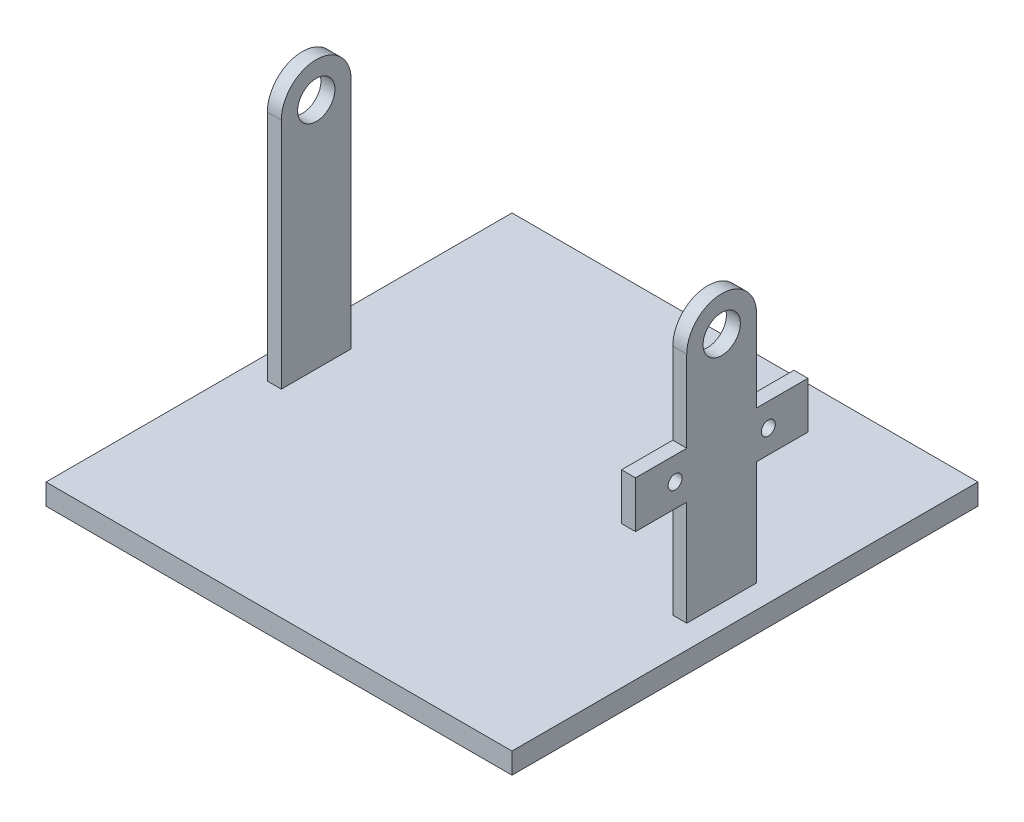
ISO-10303-21;
HEADER;
FILE_DESCRIPTION(('STEP AP214'),'2;1');
FILE_NAME('part.step','',(''),(''),'','','');
FILE_SCHEMA(('AUTOMOTIVE_DESIGN { 1 0 10303 214 1 1 1 1 }'));
ENDSEC;
DATA;
#1=APPLICATION_CONTEXT('core data for automotive mechanical design processes');
#2=APPLICATION_PROTOCOL_DEFINITION('international standard','automotive_design',2000,#1);
#3=PRODUCT_CONTEXT('',#1,'mechanical');
#4=PRODUCT('Part','Part','',(#3));
#5=PRODUCT_RELATED_PRODUCT_CATEGORY('part','',(#4));
#6=PRODUCT_DEFINITION_FORMATION('','',#4);
#7=PRODUCT_DEFINITION_CONTEXT('part definition',#1,'design');
#8=PRODUCT_DEFINITION('design','',#6,#7);
#9=PRODUCT_DEFINITION_SHAPE('','',#8);
#10=(LENGTH_UNIT() NAMED_UNIT(*) SI_UNIT(.MILLI.,.METRE.));
#11=(NAMED_UNIT(*) PLANE_ANGLE_UNIT() SI_UNIT($,.RADIAN.));
#12=(NAMED_UNIT(*) SI_UNIT($,.STERADIAN.) SOLID_ANGLE_UNIT());
#13=UNCERTAINTY_MEASURE_WITH_UNIT(LENGTH_MEASURE(1.E-05),#10,'distance_accuracy_value','');
#14=(GEOMETRIC_REPRESENTATION_CONTEXT(3) GLOBAL_UNCERTAINTY_ASSIGNED_CONTEXT((#13)) GLOBAL_UNIT_ASSIGNED_CONTEXT((#10,
#11,#12)) REPRESENTATION_CONTEXT('',''));
#15=CARTESIAN_POINT('',(0.,0.,0.));
#16=DIRECTION('',(0.,0.,1.));
#17=DIRECTION('',(1.,0.,0.));
#18=AXIS2_PLACEMENT_3D('',#15,#16,#17);
#19=CARTESIAN_POINT('',(45.,64.5,-7.50000000000004));
#20=DIRECTION('',(0.,0.,1.));
#21=DIRECTION('',(1.,0.,0.));
#22=AXIS2_PLACEMENT_3D('',#19,#20,#21);
#23=PLANE('',#22);
#24=DIRECTION('',(0.,-1.,0.));
#25=VECTOR('',#24,1.);
#26=CARTESIAN_POINT('',(45.,64.5,-7.50000000000004));
#27=LINE('',#26,#25);
#28=CARTESIAN_POINT('',(45.,54.5,-7.49999999999998));
#29=VERTEX_POINT('',#28);
#30=CARTESIAN_POINT('',(45.,37.02,-7.50000000000004));
#31=VERTEX_POINT('',#30);
#32=EDGE_CURVE('E62',#29,#31,#27,.T.);
#33=ORIENTED_EDGE('',*,*,#32,.T.);
#34=DIRECTION('',(-1.,0.,0.));
#35=VECTOR('',#34,1.);
#36=CARTESIAN_POINT('',(45.,37.02,-7.50000000000004));
#37=LINE('',#36,#35);
#38=CARTESIAN_POINT('',(42.,37.02,-7.50000000000004));
#39=VERTEX_POINT('',#38);
#40=EDGE_CURVE('E409',#31,#39,#37,.T.);
#41=ORIENTED_EDGE('',*,*,#40,.T.);
#42=DIRECTION('',(0.,-1.,0.));
#43=VECTOR('',#42,1.);
#44=CARTESIAN_POINT('',(42.,64.5,-7.50000000000004));
#45=LINE('',#44,#43);
#46=CARTESIAN_POINT('',(42.,54.5,-7.49999999999998));
#47=VERTEX_POINT('',#46);
#48=EDGE_CURVE('E279',#47,#39,#45,.T.);
#49=ORIENTED_EDGE('',*,*,#48,.F.);
#50=DIRECTION('',(1.,0.,0.));
#51=VECTOR('',#50,1.);
#52=CARTESIAN_POINT('',(-50.,54.5,-7.49999999999998));
#53=LINE('',#52,#51);
#54=EDGE_CURVE('E410',#47,#29,#53,.T.);
#55=ORIENTED_EDGE('',*,*,#54,.T.);
#56=EDGE_LOOP('',(#33,#41,#49,#55));
#57=FACE_BOUND('',#56,.T.);
#58=ADVANCED_FACE('F46',(#57),#23,.F.);
#59=CARTESIAN_POINT('',(45.,64.5,7.49999999999996));
#60=DIRECTION('',(0.,0.,-1.));
#61=DIRECTION('',(-1.,0.,0.));
#62=AXIS2_PLACEMENT_3D('',#59,#60,#61);
#63=PLANE('',#62);
#64=DIRECTION('',(0.,-1.,0.));
#65=VECTOR('',#64,1.);
#66=CARTESIAN_POINT('',(42.,64.5,7.49999999999996));
#67=LINE('',#66,#65);
#68=CARTESIAN_POINT('',(42.,54.5,7.49999999999996));
#69=VERTEX_POINT('',#68);
#70=CARTESIAN_POINT('',(42.,37.02,7.49999999999997));
#71=VERTEX_POINT('',#70);
#72=EDGE_CURVE('E254',#69,#71,#67,.T.);
#73=ORIENTED_EDGE('',*,*,#72,.T.);
#74=DIRECTION('',(1.,0.,0.));
#75=VECTOR('',#74,1.);
#76=CARTESIAN_POINT('',(45.,37.02,7.49999999999996));
#77=LINE('',#76,#75);
#78=CARTESIAN_POINT('',(45.,37.02,7.49999999999996));
#79=VERTEX_POINT('',#78);
#80=EDGE_CURVE('E12',#71,#79,#77,.T.);
#81=ORIENTED_EDGE('',*,*,#80,.T.);
#82=DIRECTION('',(0.,-1.,0.));
#83=VECTOR('',#82,1.);
#84=CARTESIAN_POINT('',(45.,64.5,7.49999999999996));
#85=LINE('',#84,#83);
#86=CARTESIAN_POINT('',(45.,54.5,7.49999999999997));
#87=VERTEX_POINT('',#86);
#88=EDGE_CURVE('E246',#87,#79,#85,.T.);
#89=ORIENTED_EDGE('',*,*,#88,.F.);
#90=DIRECTION('',(1.,0.,0.));
#91=VECTOR('',#90,1.);
#92=CARTESIAN_POINT('',(-50.,54.5,7.49999999999997));
#93=LINE('',#92,#91);
#94=EDGE_CURVE('E405',#69,#87,#93,.T.);
#95=ORIENTED_EDGE('',*,*,#94,.F.);
#96=EDGE_LOOP('',(#73,#81,#89,#95));
#97=FACE_BOUND('',#96,.T.);
#98=ADVANCED_FACE('F475',(#97),#63,.F.);
#99=CARTESIAN_POINT('',(-45.,64.5,-7.50000000000003));
#100=DIRECTION('',(0.,0.,1.));
#101=DIRECTION('',(1.,0.,0.));
#102=AXIS2_PLACEMENT_3D('',#99,#100,#101);
#103=PLANE('',#102);
#104=CARTESIAN_POINT('',(-45.,54.5,-7.49999999999998));
#105=VERTEX_POINT('',#104);
#106=CARTESIAN_POINT('',(-42.,54.5,-7.49999999999998));
#107=VERTEX_POINT('',#106);
#108=EDGE_CURVE('E404',#105,#107,#53,.T.);
#109=ORIENTED_EDGE('',*,*,#108,.T.);
#110=DIRECTION('',(0.,-1.,0.));
#111=VECTOR('',#110,1.);
#112=CARTESIAN_POINT('',(-42.,64.5,-7.50000000000003));
#113=LINE('',#112,#111);
#114=CARTESIAN_POINT('',(-42.,4.5,-7.50000000000003));
#115=VERTEX_POINT('',#114);
#116=EDGE_CURVE('E318',#107,#115,#113,.T.);
#117=ORIENTED_EDGE('',*,*,#116,.T.);
#118=DIRECTION('',(-1.,0.,0.));
#119=VECTOR('',#118,1.);
#120=CARTESIAN_POINT('',(-45.,4.5,-7.50000000000003));
#121=LINE('',#120,#119);
#122=CARTESIAN_POINT('',(-45.,4.5,-7.50000000000003));
#123=VERTEX_POINT('',#122);
#124=EDGE_CURVE('E546',#115,#123,#121,.T.);
#125=ORIENTED_EDGE('',*,*,#124,.T.);
#126=DIRECTION('',(0.,-1.,0.));
#127=VECTOR('',#126,1.);
#128=CARTESIAN_POINT('',(-45.,64.5,-7.50000000000003));
#129=LINE('',#128,#127);
#130=EDGE_CURVE('E566',#105,#123,#129,.T.);
#131=ORIENTED_EDGE('',*,*,#130,.F.);
#132=EDGE_LOOP('',(#109,#117,#125,#131));
#133=FACE_BOUND('',#132,.T.);
#134=ADVANCED_FACE('F480',(#133),#103,.F.);
#135=CARTESIAN_POINT('',(42.,27.02,-7.50000000000004));
#136=VERTEX_POINT('',#135);
#137=CARTESIAN_POINT('',(42.,4.5,-7.50000000000004));
#138=VERTEX_POINT('',#137);
#139=EDGE_CURVE('E70',#136,#138,#45,.T.);
#140=ORIENTED_EDGE('',*,*,#139,.F.);
#141=DIRECTION('',(1.,0.,0.));
#142=VECTOR('',#141,1.);
#143=CARTESIAN_POINT('',(45.,27.02,-7.50000000000004));
#144=LINE('',#143,#142);
#145=CARTESIAN_POINT('',(45.,27.02,-7.50000000000004));
#146=VERTEX_POINT('',#145);
#147=EDGE_CURVE('E192',#136,#146,#144,.T.);
#148=ORIENTED_EDGE('',*,*,#147,.T.);
#149=CARTESIAN_POINT('',(45.,4.5,-7.50000000000004));
#150=VERTEX_POINT('',#149);
#151=EDGE_CURVE('E276',#146,#150,#27,.T.);
#152=ORIENTED_EDGE('',*,*,#151,.T.);
#153=DIRECTION('',(-1.,0.,0.));
#154=VECTOR('',#153,1.);
#155=CARTESIAN_POINT('',(45.,4.5,-7.50000000000004));
#156=LINE('',#155,#154);
#157=EDGE_CURVE('E285',#150,#138,#156,.T.);
#158=ORIENTED_EDGE('',*,*,#157,.T.);
#159=EDGE_LOOP('',(#140,#148,#152,#158));
#160=FACE_BOUND('',#159,.T.);
#161=ADVANCED_FACE('F374',(#160),#23,.F.);
#162=CARTESIAN_POINT('',(0.,4.5,0.));
#163=DIRECTION('',(0.,-1.,0.));
#164=DIRECTION('',(0.,0.,-1.));
#165=AXIS2_PLACEMENT_3D('',#162,#163,#164);
#166=PLANE('',#165);
#167=DIRECTION('',(0.,0.,-1.));
#168=VECTOR('',#167,1.);
#169=CARTESIAN_POINT('',(-42.,4.5,7.49999999999997));
#170=LINE('',#169,#168);
#171=CARTESIAN_POINT('',(-42.,4.5,7.49999999999997));
#172=VERTEX_POINT('',#171);
#173=EDGE_CURVE('E296',#172,#115,#170,.T.);
#174=ORIENTED_EDGE('',*,*,#173,.F.);
#175=DIRECTION('',(1.,0.,0.));
#176=VECTOR('',#175,1.);
#177=CARTESIAN_POINT('',(-45.,4.5,7.49999999999997));
#178=LINE('',#177,#176);
#179=CARTESIAN_POINT('',(-45.,4.5,7.49999999999997));
#180=VERTEX_POINT('',#179);
#181=EDGE_CURVE('E555',#180,#172,#178,.T.);
#182=ORIENTED_EDGE('',*,*,#181,.F.);
#183=DIRECTION('',(0.,0.,1.));
#184=VECTOR('',#183,1.);
#185=CARTESIAN_POINT('',(-45.,4.5,7.49999999999997));
#186=LINE('',#185,#184);
#187=EDGE_CURVE('E550',#123,#180,#186,.T.);
#188=ORIENTED_EDGE('',*,*,#187,.F.);
#189=ORIENTED_EDGE('',*,*,#124,.F.);
#190=EDGE_LOOP('',(#174,#182,#188,#189));
#191=FACE_BOUND('',#190,.T.);
#192=DIRECTION('',(0.,0.,-1.));
#193=VECTOR('',#192,1.);
#194=CARTESIAN_POINT('',(50.,4.5,50.));
#195=LINE('',#194,#193);
#196=CARTESIAN_POINT('',(50.,4.5,50.));
#197=VERTEX_POINT('',#196);
#198=CARTESIAN_POINT('',(50.,4.5,-50.));
#199=VERTEX_POINT('',#198);
#200=EDGE_CURVE('E327',#197,#199,#195,.T.);
#201=ORIENTED_EDGE('',*,*,#200,.T.);
#202=DIRECTION('',(-1.,0.,0.));
#203=VECTOR('',#202,1.);
#204=CARTESIAN_POINT('',(-50.,4.5,-50.));
#205=LINE('',#204,#203);
#206=CARTESIAN_POINT('',(-50.,4.5,-50.));
#207=VERTEX_POINT('',#206);
#208=EDGE_CURVE('E534',#199,#207,#205,.T.);
#209=ORIENTED_EDGE('',*,*,#208,.T.);
#210=DIRECTION('',(0.,0.,1.));
#211=VECTOR('',#210,1.);
#212=CARTESIAN_POINT('',(-50.,4.5,50.));
#213=LINE('',#212,#211);
#214=CARTESIAN_POINT('',(-50.,4.5,50.));
#215=VERTEX_POINT('',#214);
#216=EDGE_CURVE('E310',#207,#215,#213,.T.);
#217=ORIENTED_EDGE('',*,*,#216,.T.);
#218=DIRECTION('',(1.,0.,0.));
#219=VECTOR('',#218,1.);
#220=CARTESIAN_POINT('',(-50.,4.5,50.));
#221=LINE('',#220,#219);
#222=EDGE_CURVE('E305',#215,#197,#221,.T.);
#223=ORIENTED_EDGE('',*,*,#222,.T.);
#224=EDGE_LOOP('',(#201,#209,#217,#223));
#225=FACE_BOUND('',#224,.T.);
#226=DIRECTION('',(0.,0.,-1.));
#227=VECTOR('',#226,1.);
#228=CARTESIAN_POINT('',(45.,4.5,7.49999999999996));
#229=LINE('',#228,#227);
#230=CARTESIAN_POINT('',(45.,4.5,7.49999999999996));
#231=VERTEX_POINT('',#230);
#232=EDGE_CURVE('E289',#231,#150,#229,.T.);
#233=ORIENTED_EDGE('',*,*,#232,.F.);
#234=DIRECTION('',(1.,0.,0.));
#235=VECTOR('',#234,1.);
#236=CARTESIAN_POINT('',(45.,4.5,7.49999999999996));
#237=LINE('',#236,#235);
#238=CARTESIAN_POINT('',(42.,4.5,7.49999999999996));
#239=VERTEX_POINT('',#238);
#240=EDGE_CURVE('E252',#239,#231,#237,.T.);
#241=ORIENTED_EDGE('',*,*,#240,.F.);
#242=DIRECTION('',(0.,0.,1.));
#243=VECTOR('',#242,1.);
#244=CARTESIAN_POINT('',(42.,4.5,7.49999999999996));
#245=LINE('',#244,#243);
#246=EDGE_CURVE('E290',#138,#239,#245,.T.);
#247=ORIENTED_EDGE('',*,*,#246,.F.);
#248=ORIENTED_EDGE('',*,*,#157,.F.);
#249=EDGE_LOOP('',(#233,#241,#247,#248));
#250=FACE_BOUND('',#249,.T.);
#251=ADVANCED_FACE('F372',(#191,#225,#250),#166,.F.);
#252=CARTESIAN_POINT('',(50.,4.5,50.));
#253=DIRECTION('',(-1.,0.,0.));
#254=DIRECTION('',(0.,0.,1.));
#255=AXIS2_PLACEMENT_3D('',#252,#253,#254);
#256=PLANE('',#255);
#257=DIRECTION('',(0.,0.,-1.));
#258=VECTOR('',#257,1.);
#259=CARTESIAN_POINT('',(50.,0.,50.));
#260=LINE('',#259,#258);
#261=CARTESIAN_POINT('',(50.,0.,50.));
#262=VERTEX_POINT('',#261);
#263=CARTESIAN_POINT('',(50.,0.,-50.));
#264=VERTEX_POINT('',#263);
#265=EDGE_CURVE('E313',#262,#264,#260,.T.);
#266=ORIENTED_EDGE('',*,*,#265,.T.);
#267=DIRECTION('',(0.,-1.,0.));
#268=VECTOR('',#267,1.);
#269=CARTESIAN_POINT('',(50.,4.5,-50.));
#270=LINE('',#269,#268);
#271=EDGE_CURVE('E339',#199,#264,#270,.T.);
#272=ORIENTED_EDGE('',*,*,#271,.F.);
#273=ORIENTED_EDGE('',*,*,#200,.F.);
#274=DIRECTION('',(0.,-1.,0.));
#275=VECTOR('',#274,1.);
#276=CARTESIAN_POINT('',(50.,4.5,50.));
#277=LINE('',#276,#275);
#278=EDGE_CURVE('E309',#197,#262,#277,.T.);
#279=ORIENTED_EDGE('',*,*,#278,.T.);
#280=EDGE_LOOP('',(#266,#272,#273,#279));
#281=FACE_BOUND('',#280,.T.);
#282=ADVANCED_FACE('F48',(#281),#256,.F.);
#283=CARTESIAN_POINT('',(-50.,4.5,-50.));
#284=DIRECTION('',(0.,0.,1.));
#285=DIRECTION('',(1.,0.,0.));
#286=AXIS2_PLACEMENT_3D('',#283,#284,#285);
#287=PLANE('',#286);
#288=DIRECTION('',(-1.,0.,0.));
#289=VECTOR('',#288,1.);
#290=CARTESIAN_POINT('',(-50.,0.,-50.));
#291=LINE('',#290,#289);
#292=CARTESIAN_POINT('',(-50.,0.,-50.));
#293=VERTEX_POINT('',#292);
#294=EDGE_CURVE('E317',#264,#293,#291,.T.);
#295=ORIENTED_EDGE('',*,*,#294,.T.);
#296=DIRECTION('',(0.,-1.,0.));
#297=VECTOR('',#296,1.);
#298=CARTESIAN_POINT('',(-50.,4.5,-50.));
#299=LINE('',#298,#297);
#300=EDGE_CURVE('E335',#207,#293,#299,.T.);
#301=ORIENTED_EDGE('',*,*,#300,.F.);
#302=ORIENTED_EDGE('',*,*,#208,.F.);
#303=ORIENTED_EDGE('',*,*,#271,.T.);
#304=EDGE_LOOP('',(#295,#301,#302,#303));
#305=FACE_BOUND('',#304,.T.);
#306=ADVANCED_FACE('F513',(#305),#287,.F.);
#307=CARTESIAN_POINT('',(-50.,4.5,50.));
#308=DIRECTION('',(1.,0.,0.));
#309=DIRECTION('',(0.,0.,-1.));
#310=AXIS2_PLACEMENT_3D('',#307,#308,#309);
#311=PLANE('',#310);
#312=DIRECTION('',(0.,0.,1.));
#313=VECTOR('',#312,1.);
#314=CARTESIAN_POINT('',(-50.,0.,50.));
#315=LINE('',#314,#313);
#316=CARTESIAN_POINT('',(-50.,0.,50.));
#317=VERTEX_POINT('',#316);
#318=EDGE_CURVE('E321',#293,#317,#315,.T.);
#319=ORIENTED_EDGE('',*,*,#318,.T.);
#320=DIRECTION('',(0.,-1.,0.));
#321=VECTOR('',#320,1.);
#322=CARTESIAN_POINT('',(-50.,4.5,50.));
#323=LINE('',#322,#321);
#324=EDGE_CURVE('E331',#215,#317,#323,.T.);
#325=ORIENTED_EDGE('',*,*,#324,.F.);
#326=ORIENTED_EDGE('',*,*,#216,.F.);
#327=ORIENTED_EDGE('',*,*,#300,.T.);
#328=EDGE_LOOP('',(#319,#325,#326,#327));
#329=FACE_BOUND('',#328,.T.);
#330=ADVANCED_FACE('F510',(#329),#311,.F.);
#331=CARTESIAN_POINT('',(-50.,4.5,50.));
#332=DIRECTION('',(0.,0.,-1.));
#333=DIRECTION('',(-1.,0.,0.));
#334=AXIS2_PLACEMENT_3D('',#331,#332,#333);
#335=PLANE('',#334);
#336=DIRECTION('',(1.,0.,0.));
#337=VECTOR('',#336,1.);
#338=CARTESIAN_POINT('',(-50.,0.,50.));
#339=LINE('',#338,#337);
#340=EDGE_CURVE('E324',#317,#262,#339,.T.);
#341=ORIENTED_EDGE('',*,*,#340,.T.);
#342=ORIENTED_EDGE('',*,*,#278,.F.);
#343=ORIENTED_EDGE('',*,*,#222,.F.);
#344=ORIENTED_EDGE('',*,*,#324,.T.);
#345=EDGE_LOOP('',(#341,#342,#343,#344));
#346=FACE_BOUND('',#345,.T.);
#347=ADVANCED_FACE('F506',(#346),#335,.F.);
#348=CARTESIAN_POINT('',(0.,0.,0.));
#349=DIRECTION('',(0.,-1.,0.));
#350=DIRECTION('',(0.,0.,-1.));
#351=AXIS2_PLACEMENT_3D('',#348,#349,#350);
#352=PLANE('',#351);
#353=ORIENTED_EDGE('',*,*,#265,.F.);
#354=ORIENTED_EDGE('',*,*,#340,.F.);
#355=ORIENTED_EDGE('',*,*,#318,.F.);
#356=ORIENTED_EDGE('',*,*,#294,.F.);
#357=EDGE_LOOP('',(#353,#354,#355,#356));
#358=FACE_BOUND('',#357,.T.);
#359=ADVANCED_FACE('F502',(#358),#352,.T.);
#360=CARTESIAN_POINT('',(-42.,64.5,7.49999999999997));
#361=DIRECTION('',(-1.,0.,0.));
#362=DIRECTION('',(0.,0.,1.));
#363=AXIS2_PLACEMENT_3D('',#360,#361,#362);
#364=PLANE('',#363);
#365=CARTESIAN_POINT('',(-42.,54.5,0.));
#366=DIRECTION('',(-1.,0.,0.));
#367=DIRECTION('',(0.,0.,1.));
#368=AXIS2_PLACEMENT_3D('',#365,#366,#367);
#369=CIRCLE('',#368,4.);
#370=CARTESIAN_POINT('',(-42.,54.5,4.));
#371=VERTEX_POINT('',#370);
#372=EDGE_CURVE('E277',#371,#371,#369,.T.);
#373=ORIENTED_EDGE('',*,*,#372,.T.);
#374=EDGE_LOOP('',(#373));
#375=FACE_BOUND('',#374,.T.);
#376=ORIENTED_EDGE('',*,*,#116,.F.);
#377=CARTESIAN_POINT('',(-42.,54.5,0.));
#378=DIRECTION('',(-1.,0.,0.));
#379=DIRECTION('',(0.,0.,1.));
#380=AXIS2_PLACEMENT_3D('',#377,#378,#379);
#381=CIRCLE('',#380,7.49999999999997);
#382=CARTESIAN_POINT('',(-42.,54.5,7.49999999999997));
#383=VERTEX_POINT('',#382);
#384=EDGE_CURVE('E347',#107,#383,#381,.F.);
#385=ORIENTED_EDGE('',*,*,#384,.T.);
#386=DIRECTION('',(0.,-1.,0.));
#387=VECTOR('',#386,1.);
#388=CARTESIAN_POINT('',(-42.,64.5,7.49999999999997));
#389=LINE('',#388,#387);
#390=EDGE_CURVE('E560',#383,#172,#389,.T.);
#391=ORIENTED_EDGE('',*,*,#390,.T.);
#392=ORIENTED_EDGE('',*,*,#173,.T.);
#393=EDGE_LOOP('',(#376,#385,#391,#392));
#394=FACE_BOUND('',#393,.T.);
#395=ADVANCED_FACE('F500',(#375,#394),#364,.F.);
#396=CARTESIAN_POINT('',(-45.,64.5,7.49999999999997));
#397=DIRECTION('',(1.,0.,0.));
#398=DIRECTION('',(0.,0.,-1.));
#399=AXIS2_PLACEMENT_3D('',#396,#397,#398);
#400=PLANE('',#399);
#401=CARTESIAN_POINT('',(-45.,54.5,0.));
#402=DIRECTION('',(1.,0.,0.));
#403=DIRECTION('',(0.,0.,-1.));
#404=AXIS2_PLACEMENT_3D('',#401,#402,#403);
#405=CIRCLE('',#404,4.);
#406=CARTESIAN_POINT('',(-45.,54.5,-4.));
#407=VERTEX_POINT('',#406);
#408=EDGE_CURVE('E346',#407,#407,#405,.T.);
#409=ORIENTED_EDGE('',*,*,#408,.T.);
#410=EDGE_LOOP('',(#409));
#411=FACE_BOUND('',#410,.T.);
#412=DIRECTION('',(0.,-1.,0.));
#413=VECTOR('',#412,1.);
#414=CARTESIAN_POINT('',(-45.,64.5,7.49999999999997));
#415=LINE('',#414,#413);
#416=CARTESIAN_POINT('',(-45.,54.5,7.49999999999997));
#417=VERTEX_POINT('',#416);
#418=EDGE_CURVE('E564',#417,#180,#415,.T.);
#419=ORIENTED_EDGE('',*,*,#418,.F.);
#420=CARTESIAN_POINT('',(-45.,54.5,0.));
#421=DIRECTION('',(1.,0.,0.));
#422=DIRECTION('',(0.,0.,-1.));
#423=AXIS2_PLACEMENT_3D('',#420,#421,#422);
#424=CIRCLE('',#423,7.49999999999997);
#425=EDGE_CURVE('E389',#417,#105,#424,.F.);
#426=ORIENTED_EDGE('',*,*,#425,.T.);
#427=ORIENTED_EDGE('',*,*,#130,.T.);
#428=ORIENTED_EDGE('',*,*,#187,.T.);
#429=EDGE_LOOP('',(#419,#426,#427,#428));
#430=FACE_BOUND('',#429,.T.);
#431=ADVANCED_FACE('F498',(#411,#430),#400,.F.);
#432=CARTESIAN_POINT('',(-45.,64.5,7.49999999999997));
#433=DIRECTION('',(0.,0.,-1.));
#434=DIRECTION('',(-1.,0.,0.));
#435=AXIS2_PLACEMENT_3D('',#432,#433,#434);
#436=PLANE('',#435);
#437=ORIENTED_EDGE('',*,*,#390,.F.);
#438=EDGE_CURVE('E408',#417,#383,#93,.T.);
#439=ORIENTED_EDGE('',*,*,#438,.F.);
#440=ORIENTED_EDGE('',*,*,#418,.T.);
#441=ORIENTED_EDGE('',*,*,#181,.T.);
#442=EDGE_LOOP('',(#437,#439,#440,#441));
#443=FACE_BOUND('',#442,.T.);
#444=ADVANCED_FACE('F457',(#443),#436,.F.);
#445=CARTESIAN_POINT('',(45.,64.5,7.49999999999996));
#446=DIRECTION('',(-1.,0.,0.));
#447=DIRECTION('',(0.,0.,1.));
#448=AXIS2_PLACEMENT_3D('',#445,#446,#447);
#449=PLANE('',#448);
#450=ORIENTED_EDGE('',*,*,#151,.F.);
#451=DIRECTION('',(0.,0.,-1.));
#452=VECTOR('',#451,1.);
#453=CARTESIAN_POINT('',(45.,27.02,0.));
#454=LINE('',#453,#452);
#455=CARTESIAN_POINT('',(45.,27.02,-18.5));
#456=VERTEX_POINT('',#455);
#457=EDGE_CURVE('E231',#146,#456,#454,.T.);
#458=ORIENTED_EDGE('',*,*,#457,.T.);
#459=DIRECTION('',(0.,1.,0.));
#460=VECTOR('',#459,1.);
#461=CARTESIAN_POINT('',(45.,27.02,-18.5));
#462=LINE('',#461,#460);
#463=CARTESIAN_POINT('',(45.,37.02,-18.5));
#464=VERTEX_POINT('',#463);
#465=EDGE_CURVE('E204',#456,#464,#462,.T.);
#466=ORIENTED_EDGE('',*,*,#465,.T.);
#467=DIRECTION('',(0.,0.,1.));
#468=VECTOR('',#467,1.);
#469=CARTESIAN_POINT('',(45.,37.02,-18.5));
#470=LINE('',#469,#468);
#471=EDGE_CURVE('E263',#464,#31,#470,.T.);
#472=ORIENTED_EDGE('',*,*,#471,.T.);
#473=ORIENTED_EDGE('',*,*,#32,.F.);
#474=CARTESIAN_POINT('',(45.,54.5,0.));
#475=DIRECTION('',(-1.,0.,0.));
#476=DIRECTION('',(0.,0.,-1.));
#477=AXIS2_PLACEMENT_3D('',#474,#475,#476);
#478=CIRCLE('',#477,7.49999999999997);
#479=EDGE_CURVE('E400',#87,#29,#478,.T.);
#480=ORIENTED_EDGE('',*,*,#479,.F.);
#481=ORIENTED_EDGE('',*,*,#88,.T.);
#482=CARTESIAN_POINT('',(45.,37.02,18.5));
#483=VERTEX_POINT('',#482);
#484=EDGE_CURVE('E267',#79,#483,#470,.T.);
#485=ORIENTED_EDGE('',*,*,#484,.T.);
#486=DIRECTION('',(0.,-1.,0.));
#487=VECTOR('',#486,1.);
#488=CARTESIAN_POINT('',(45.,37.02,18.5));
#489=LINE('',#488,#487);
#490=CARTESIAN_POINT('',(45.,27.02,18.5));
#491=VERTEX_POINT('',#490);
#492=EDGE_CURVE('E197',#483,#491,#489,.T.);
#493=ORIENTED_EDGE('',*,*,#492,.T.);
#494=CARTESIAN_POINT('',(45.,27.02,7.49999999999996));
#495=VERTEX_POINT('',#494);
#496=EDGE_CURVE('E227',#491,#495,#454,.T.);
#497=ORIENTED_EDGE('',*,*,#496,.T.);
#498=EDGE_CURVE('E253',#495,#231,#85,.T.);
#499=ORIENTED_EDGE('',*,*,#498,.T.);
#500=ORIENTED_EDGE('',*,*,#232,.T.);
#501=EDGE_LOOP('',(#450,#458,#466,#472,#473,#480,#481,#485,#493,#497,#499,#500));
#502=FACE_BOUND('',#501,.T.);
#503=CARTESIAN_POINT('',(45.,32.02,10.));
#504=DIRECTION('',(1.,0.,0.));
#505=DIRECTION('',(0.,0.,-1.));
#506=AXIS2_PLACEMENT_3D('',#503,#504,#505);
#507=CIRCLE('',#506,1.5);
#508=CARTESIAN_POINT('',(45.,32.02,8.5));
#509=VERTEX_POINT('',#508);
#510=EDGE_CURVE('E447',#509,#509,#507,.T.);
#511=ORIENTED_EDGE('',*,*,#510,.F.);
#512=EDGE_LOOP('',(#511));
#513=FACE_BOUND('',#512,.T.);
#514=CARTESIAN_POINT('',(45.,54.5,0.));
#515=DIRECTION('',(1.,0.,0.));
#516=DIRECTION('',(0.,0.,-1.));
#517=AXIS2_PLACEMENT_3D('',#514,#515,#516);
#518=CIRCLE('',#517,4.);
#519=CARTESIAN_POINT('',(45.,54.5,-4.));
#520=VERTEX_POINT('',#519);
#521=EDGE_CURVE('E396',#520,#520,#518,.T.);
#522=ORIENTED_EDGE('',*,*,#521,.F.);
#523=EDGE_LOOP('',(#522));
#524=FACE_BOUND('',#523,.T.);
#525=CARTESIAN_POINT('',(45.,32.02,-10.));
#526=DIRECTION('',(1.,0.,0.));
#527=DIRECTION('',(0.,0.,-1.));
#528=AXIS2_PLACEMENT_3D('',#525,#526,#527);
#529=CIRCLE('',#528,1.5);
#530=CARTESIAN_POINT('',(45.,32.02,-11.5));
#531=VERTEX_POINT('',#530);
#532=EDGE_CURVE('E440',#531,#531,#529,.T.);
#533=ORIENTED_EDGE('',*,*,#532,.F.);
#534=EDGE_LOOP('',(#533));
#535=FACE_BOUND('',#534,.T.);
#536=ADVANCED_FACE('F430',(#502,#513,#524,#535),#449,.F.);
#537=CARTESIAN_POINT('',(42.,64.5,7.49999999999996));
#538=DIRECTION('',(1.,0.,0.));
#539=DIRECTION('',(0.,0.,-1.));
#540=AXIS2_PLACEMENT_3D('',#537,#538,#539);
#541=PLANE('',#540);
#542=CARTESIAN_POINT('',(42.,27.02,7.49999999999996));
#543=VERTEX_POINT('',#542);
#544=EDGE_CURVE('E355',#543,#239,#67,.T.);
#545=ORIENTED_EDGE('',*,*,#544,.F.);
#546=DIRECTION('',(0.,0.,-1.));
#547=VECTOR('',#546,1.);
#548=CARTESIAN_POINT('',(42.,27.02,18.5));
#549=LINE('',#548,#547);
#550=CARTESIAN_POINT('',(42.,27.02,18.5));
#551=VERTEX_POINT('',#550);
#552=EDGE_CURVE('E196',#551,#543,#549,.T.);
#553=ORIENTED_EDGE('',*,*,#552,.F.);
#554=DIRECTION('',(0.,-1.,0.));
#555=VECTOR('',#554,1.);
#556=CARTESIAN_POINT('',(42.,37.02,18.5));
#557=LINE('',#556,#555);
#558=CARTESIAN_POINT('',(42.,37.02,18.5));
#559=VERTEX_POINT('',#558);
#560=EDGE_CURVE('E207',#559,#551,#557,.T.);
#561=ORIENTED_EDGE('',*,*,#560,.F.);
#562=DIRECTION('',(0.,0.,1.));
#563=VECTOR('',#562,1.);
#564=CARTESIAN_POINT('',(42.,37.02,-18.5));
#565=LINE('',#564,#563);
#566=EDGE_CURVE('E217',#71,#559,#565,.T.);
#567=ORIENTED_EDGE('',*,*,#566,.F.);
#568=ORIENTED_EDGE('',*,*,#72,.F.);
#569=CARTESIAN_POINT('',(42.,54.5,0.));
#570=DIRECTION('',(1.,0.,0.));
#571=DIRECTION('',(0.,0.,-1.));
#572=AXIS2_PLACEMENT_3D('',#569,#570,#571);
#573=CIRCLE('',#572,7.49999999999997);
#574=EDGE_CURVE('E393',#69,#47,#573,.F.);
#575=ORIENTED_EDGE('',*,*,#574,.T.);
#576=ORIENTED_EDGE('',*,*,#48,.T.);
#577=CARTESIAN_POINT('',(42.,37.02,-18.5));
#578=VERTEX_POINT('',#577);
#579=EDGE_CURVE('E215',#578,#39,#565,.T.);
#580=ORIENTED_EDGE('',*,*,#579,.F.);
#581=DIRECTION('',(0.,1.,0.));
#582=VECTOR('',#581,1.);
#583=CARTESIAN_POINT('',(42.,27.02,-18.5));
#584=LINE('',#583,#582);
#585=CARTESIAN_POINT('',(42.,27.02,-18.5));
#586=VERTEX_POINT('',#585);
#587=EDGE_CURVE('E202',#586,#578,#584,.T.);
#588=ORIENTED_EDGE('',*,*,#587,.F.);
#589=EDGE_CURVE('E186',#136,#586,#549,.T.);
#590=ORIENTED_EDGE('',*,*,#589,.F.);
#591=ORIENTED_EDGE('',*,*,#139,.T.);
#592=ORIENTED_EDGE('',*,*,#246,.T.);
#593=EDGE_LOOP('',(#545,#553,#561,#567,#568,#575,#576,#580,#588,#590,#591,#592));
#594=FACE_BOUND('',#593,.T.);
#595=CARTESIAN_POINT('',(42.,32.02,10.));
#596=DIRECTION('',(1.,0.,0.));
#597=DIRECTION('',(0.,0.,-1.));
#598=AXIS2_PLACEMENT_3D('',#595,#596,#597);
#599=CIRCLE('',#598,1.5);
#600=CARTESIAN_POINT('',(42.,32.02,8.5));
#601=VERTEX_POINT('',#600);
#602=EDGE_CURVE('E444',#601,#601,#599,.T.);
#603=ORIENTED_EDGE('',*,*,#602,.T.);
#604=EDGE_LOOP('',(#603));
#605=FACE_BOUND('',#604,.T.);
#606=CARTESIAN_POINT('',(42.,54.5,0.));
#607=DIRECTION('',(1.,0.,0.));
#608=DIRECTION('',(0.,0.,-1.));
#609=AXIS2_PLACEMENT_3D('',#606,#607,#608);
#610=CIRCLE('',#609,4.);
#611=CARTESIAN_POINT('',(42.,54.5,-4.));
#612=VERTEX_POINT('',#611);
#613=EDGE_CURVE('E343',#612,#612,#610,.T.);
#614=ORIENTED_EDGE('',*,*,#613,.T.);
#615=EDGE_LOOP('',(#614));
#616=FACE_BOUND('',#615,.T.);
#617=CARTESIAN_POINT('',(42.,32.02,-10.));
#618=DIRECTION('',(1.,0.,0.));
#619=DIRECTION('',(0.,0.,-1.));
#620=AXIS2_PLACEMENT_3D('',#617,#618,#619);
#621=CIRCLE('',#620,1.5);
#622=CARTESIAN_POINT('',(42.,32.02,-11.5));
#623=VERTEX_POINT('',#622);
#624=EDGE_CURVE('E437',#623,#623,#621,.T.);
#625=ORIENTED_EDGE('',*,*,#624,.T.);
#626=EDGE_LOOP('',(#625));
#627=FACE_BOUND('',#626,.T.);
#628=ADVANCED_FACE('F211',(#594,#605,#616,#627),#541,.F.);
#629=ORIENTED_EDGE('',*,*,#498,.F.);
#630=DIRECTION('',(-1.,0.,0.));
#631=VECTOR('',#630,1.);
#632=CARTESIAN_POINT('',(45.,27.02,7.49999999999996));
#633=LINE('',#632,#631);
#634=EDGE_CURVE('E55',#495,#543,#633,.T.);
#635=ORIENTED_EDGE('',*,*,#634,.T.);
#636=ORIENTED_EDGE('',*,*,#544,.T.);
#637=ORIENTED_EDGE('',*,*,#240,.T.);
#638=EDGE_LOOP('',(#629,#635,#636,#637));
#639=FACE_BOUND('',#638,.T.);
#640=ADVANCED_FACE('F353',(#639),#63,.F.);
#641=CARTESIAN_POINT('',(-50.,54.5,0.));
#642=DIRECTION('',(1.,0.,0.));
#643=DIRECTION('',(0.,0.,-1.));
#644=AXIS2_PLACEMENT_3D('',#641,#642,#643);
#645=CYLINDRICAL_SURFACE('',#644,7.49999999999997);
#646=ORIENTED_EDGE('',*,*,#94,.T.);
#647=ORIENTED_EDGE('',*,*,#479,.T.);
#648=ORIENTED_EDGE('',*,*,#54,.F.);
#649=ORIENTED_EDGE('',*,*,#574,.F.);
#650=EDGE_LOOP('',(#646,#647,#648,#649));
#651=FACE_BOUND('',#650,.T.);
#652=ADVANCED_FACE('F593',(#651),#645,.T.);
#653=CARTESIAN_POINT('',(-50.,54.5,0.));
#654=DIRECTION('',(1.,0.,0.));
#655=DIRECTION('',(0.,0.,-1.));
#656=AXIS2_PLACEMENT_3D('',#653,#654,#655);
#657=CYLINDRICAL_SURFACE('',#656,4.);
#658=ORIENTED_EDGE('',*,*,#521,.T.);
#659=EDGE_LOOP('',(#658));
#660=FACE_BOUND('',#659,.T.);
#661=ORIENTED_EDGE('',*,*,#613,.F.);
#662=EDGE_LOOP('',(#661));
#663=FACE_BOUND('',#662,.T.);
#664=ADVANCED_FACE('F591',(#660,#663),#657,.F.);
#665=ORIENTED_EDGE('',*,*,#108,.F.);
#666=ORIENTED_EDGE('',*,*,#425,.F.);
#667=ORIENTED_EDGE('',*,*,#438,.T.);
#668=ORIENTED_EDGE('',*,*,#384,.F.);
#669=EDGE_LOOP('',(#665,#666,#667,#668));
#670=FACE_BOUND('',#669,.T.);
#671=ADVANCED_FACE('F586',(#670),#645,.T.);
#672=ORIENTED_EDGE('',*,*,#408,.F.);
#673=EDGE_LOOP('',(#672));
#674=FACE_BOUND('',#673,.T.);
#675=ORIENTED_EDGE('',*,*,#372,.F.);
#676=EDGE_LOOP('',(#675));
#677=FACE_BOUND('',#676,.T.);
#678=ADVANCED_FACE('F590',(#674,#677),#657,.F.);
#679=CARTESIAN_POINT('',(42.,37.02,18.5));
#680=DIRECTION('',(0.,0.,1.));
#681=DIRECTION('',(1.,0.,0.));
#682=AXIS2_PLACEMENT_3D('',#679,#680,#681);
#683=PLANE('',#682);
#684=ORIENTED_EDGE('',*,*,#492,.F.);
#685=DIRECTION('',(1.,0.,0.));
#686=VECTOR('',#685,1.);
#687=CARTESIAN_POINT('',(42.,37.02,18.5));
#688=LINE('',#687,#686);
#689=EDGE_CURVE('E420',#559,#483,#688,.T.);
#690=ORIENTED_EDGE('',*,*,#689,.F.);
#691=ORIENTED_EDGE('',*,*,#560,.T.);
#692=DIRECTION('',(1.,0.,0.));
#693=VECTOR('',#692,1.);
#694=CARTESIAN_POINT('',(42.,27.02,18.5));
#695=LINE('',#694,#693);
#696=EDGE_CURVE('E416',#551,#491,#695,.T.);
#697=ORIENTED_EDGE('',*,*,#696,.T.);
#698=EDGE_LOOP('',(#684,#690,#691,#697));
#699=FACE_BOUND('',#698,.T.);
#700=ADVANCED_FACE('F428',(#699),#683,.T.);
#701=CARTESIAN_POINT('',(42.,32.02,10.));
#702=DIRECTION('',(1.,0.,0.));
#703=DIRECTION('',(0.,0.,-1.));
#704=AXIS2_PLACEMENT_3D('',#701,#702,#703);
#705=CYLINDRICAL_SURFACE('',#704,1.5);
#706=ORIENTED_EDGE('',*,*,#602,.F.);
#707=EDGE_LOOP('',(#706));
#708=FACE_BOUND('',#707,.T.);
#709=ORIENTED_EDGE('',*,*,#510,.T.);
#710=EDGE_LOOP('',(#709));
#711=FACE_BOUND('',#710,.T.);
#712=ADVANCED_FACE('F454',(#708,#711),#705,.F.);
#713=CARTESIAN_POINT('',(42.,27.02,0.));
#714=DIRECTION('',(0.,-1.,0.));
#715=DIRECTION('',(0.,0.,-1.));
#716=AXIS2_PLACEMENT_3D('',#713,#714,#715);
#717=PLANE('',#716);
#718=ORIENTED_EDGE('',*,*,#634,.F.);
#719=ORIENTED_EDGE('',*,*,#496,.F.);
#720=ORIENTED_EDGE('',*,*,#696,.F.);
#721=ORIENTED_EDGE('',*,*,#552,.T.);
#722=EDGE_LOOP('',(#718,#719,#720,#721));
#723=FACE_BOUND('',#722,.T.);
#724=ADVANCED_FACE('F623',(#723),#717,.T.);
#725=CARTESIAN_POINT('',(42.,37.02,-18.5));
#726=DIRECTION('',(0.,1.,0.));
#727=DIRECTION('',(0.,0.,1.));
#728=AXIS2_PLACEMENT_3D('',#725,#726,#727);
#729=PLANE('',#728);
#730=ORIENTED_EDGE('',*,*,#80,.F.);
#731=ORIENTED_EDGE('',*,*,#566,.T.);
#732=ORIENTED_EDGE('',*,*,#689,.T.);
#733=ORIENTED_EDGE('',*,*,#484,.F.);
#734=EDGE_LOOP('',(#730,#731,#732,#733));
#735=FACE_BOUND('',#734,.T.);
#736=ADVANCED_FACE('F613',(#735),#729,.T.);
#737=ORIENTED_EDGE('',*,*,#40,.F.);
#738=ORIENTED_EDGE('',*,*,#471,.F.);
#739=DIRECTION('',(1.,0.,0.));
#740=VECTOR('',#739,1.);
#741=CARTESIAN_POINT('',(42.,37.02,-18.5));
#742=LINE('',#741,#740);
#743=EDGE_CURVE('E206',#578,#464,#742,.T.);
#744=ORIENTED_EDGE('',*,*,#743,.F.);
#745=ORIENTED_EDGE('',*,*,#579,.T.);
#746=EDGE_LOOP('',(#737,#738,#744,#745));
#747=FACE_BOUND('',#746,.T.);
#748=ADVANCED_FACE('F616',(#747),#729,.T.);
#749=ORIENTED_EDGE('',*,*,#147,.F.);
#750=ORIENTED_EDGE('',*,*,#589,.T.);
#751=DIRECTION('',(1.,0.,0.));
#752=VECTOR('',#751,1.);
#753=CARTESIAN_POINT('',(42.,27.02,-18.5));
#754=LINE('',#753,#752);
#755=EDGE_CURVE('E190',#586,#456,#754,.T.);
#756=ORIENTED_EDGE('',*,*,#755,.T.);
#757=ORIENTED_EDGE('',*,*,#457,.F.);
#758=EDGE_LOOP('',(#749,#750,#756,#757));
#759=FACE_BOUND('',#758,.T.);
#760=ADVANCED_FACE('F188',(#759),#717,.T.);
#761=CARTESIAN_POINT('',(42.,27.02,-18.5));
#762=DIRECTION('',(0.,0.,-1.));
#763=DIRECTION('',(-1.,0.,0.));
#764=AXIS2_PLACEMENT_3D('',#761,#762,#763);
#765=PLANE('',#764);
#766=ORIENTED_EDGE('',*,*,#465,.F.);
#767=ORIENTED_EDGE('',*,*,#755,.F.);
#768=ORIENTED_EDGE('',*,*,#587,.T.);
#769=ORIENTED_EDGE('',*,*,#743,.T.);
#770=EDGE_LOOP('',(#766,#767,#768,#769));
#771=FACE_BOUND('',#770,.T.);
#772=ADVANCED_FACE('F201',(#771),#765,.T.);
#773=CARTESIAN_POINT('',(42.,32.02,-10.));
#774=DIRECTION('',(1.,0.,0.));
#775=DIRECTION('',(0.,0.,-1.));
#776=AXIS2_PLACEMENT_3D('',#773,#774,#775);
#777=CYLINDRICAL_SURFACE('',#776,1.5);
#778=ORIENTED_EDGE('',*,*,#624,.F.);
#779=EDGE_LOOP('',(#778));
#780=FACE_BOUND('',#779,.T.);
#781=ORIENTED_EDGE('',*,*,#532,.T.);
#782=EDGE_LOOP('',(#781));
#783=FACE_BOUND('',#782,.T.);
#784=ADVANCED_FACE('F463',(#780,#783),#777,.F.);
#785=CLOSED_SHELL('',(#58,#98,#134,#161,#251,#282,#306,#330,#347,#359,#395,#431,#444,#536,#628,
#640,#652,#664,#671,#678,#700,#712,#724,#736,#748,#760,#772,#784));
#786=MANIFOLD_SOLID_BREP('B2',#785);
#787=ADVANCED_BREP_SHAPE_REPRESENTATION('',(#18,#786),#14);
#788=SHAPE_DEFINITION_REPRESENTATION(#9,#787);
ENDSEC;
END-ISO-10303-21;
